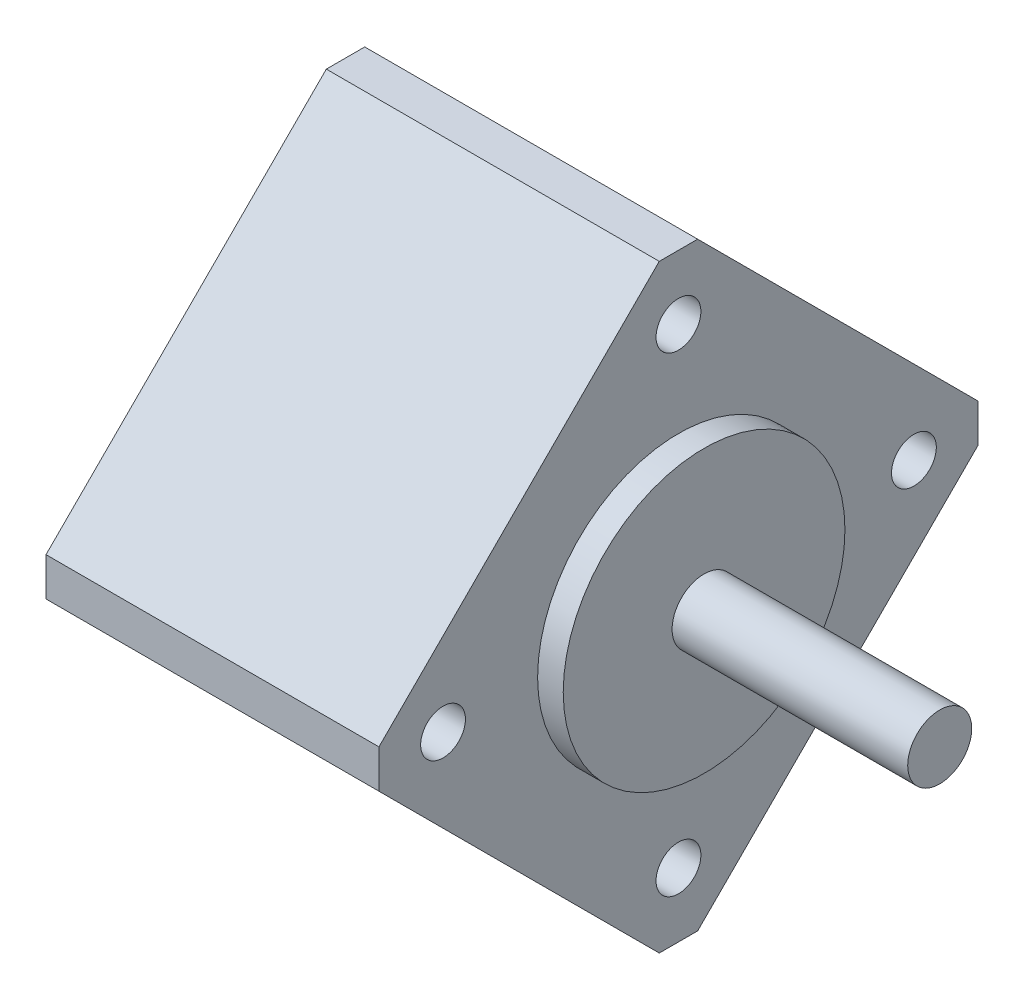
ISO-10303-21;
HEADER;
FILE_DESCRIPTION(('STEP AP214'),'2;1');
FILE_NAME('part.step','',(''),(''),'','','');
FILE_SCHEMA(('AUTOMOTIVE_DESIGN { 1 0 10303 214 1 1 1 1 }'));
ENDSEC;
DATA;
#1=APPLICATION_CONTEXT('core data for automotive mechanical design processes');
#2=APPLICATION_PROTOCOL_DEFINITION('international standard','automotive_design',2000,#1);
#3=PRODUCT_CONTEXT('',#1,'mechanical');
#4=PRODUCT('Part','Part','',(#3));
#5=PRODUCT_RELATED_PRODUCT_CATEGORY('part','',(#4));
#6=PRODUCT_DEFINITION_FORMATION('','',#4);
#7=PRODUCT_DEFINITION_CONTEXT('part definition',#1,'design');
#8=PRODUCT_DEFINITION('design','',#6,#7);
#9=PRODUCT_DEFINITION_SHAPE('','',#8);
#10=(LENGTH_UNIT() NAMED_UNIT(*) SI_UNIT(.MILLI.,.METRE.));
#11=(NAMED_UNIT(*) PLANE_ANGLE_UNIT() SI_UNIT($,.RADIAN.));
#12=(NAMED_UNIT(*) SI_UNIT($,.STERADIAN.) SOLID_ANGLE_UNIT());
#13=UNCERTAINTY_MEASURE_WITH_UNIT(LENGTH_MEASURE(1.E-05),#10,'distance_accuracy_value','');
#14=(GEOMETRIC_REPRESENTATION_CONTEXT(3) GLOBAL_UNCERTAINTY_ASSIGNED_CONTEXT((#13)) GLOBAL_UNIT_ASSIGNED_CONTEXT((#10,
#11,#12)) REPRESENTATION_CONTEXT('',''));
#15=CARTESIAN_POINT('',(0.,0.,0.));
#16=DIRECTION('',(0.,0.,1.));
#17=DIRECTION('',(1.,0.,0.));
#18=AXIS2_PLACEMENT_3D('',#15,#16,#17);
#19=CARTESIAN_POINT('',(0.,0.,0.));
#20=DIRECTION('',(-1.,0.,0.));
#21=DIRECTION('',(0.,0.,1.));
#22=AXIS2_PLACEMENT_3D('',#19,#20,#21);
#23=CYLINDRICAL_SURFACE('',#22,2.49999995299999);
#24=CARTESIAN_POINT('',(18.40000003,0.,0.));
#25=DIRECTION('',(-1.,0.,0.));
#26=DIRECTION('',(0.,0.,1.));
#27=AXIS2_PLACEMENT_3D('',#24,#25,#26);
#28=CIRCLE('',#27,2.49999995299999);
#29=CARTESIAN_POINT('',(18.40000003,0.,2.49999995299999));
#30=VERTEX_POINT('',#29);
#31=EDGE_CURVE('E171',#30,#30,#28,.T.);
#32=ORIENTED_EDGE('',*,*,#31,.T.);
#33=EDGE_LOOP('',(#32));
#34=FACE_BOUND('',#33,.T.);
#35=CARTESIAN_POINT('',(0.,0.,0.));
#36=DIRECTION('',(-1.,0.,0.));
#37=DIRECTION('',(0.,0.,1.));
#38=AXIS2_PLACEMENT_3D('',#35,#36,#37);
#39=CIRCLE('',#38,2.499999953);
#40=CARTESIAN_POINT('',(0.,0.,2.499999953));
#41=VERTEX_POINT('',#40);
#42=EDGE_CURVE('E11',#41,#41,#39,.T.);
#43=ORIENTED_EDGE('',*,*,#42,.F.);
#44=EDGE_LOOP('',(#43));
#45=FACE_BOUND('',#44,.T.);
#46=ADVANCED_FACE('F39',(#34,#45),#23,.T.);
#47=CARTESIAN_POINT('',(0.,0.,0.));
#48=DIRECTION('',(-1.,0.,0.));
#49=DIRECTION('',(0.,0.,1.));
#50=AXIS2_PLACEMENT_3D('',#47,#48,#49);
#51=PLANE('',#50);
#52=CARTESIAN_POINT('',(0.,0.,0.));
#53=DIRECTION('',(-1.,0.,0.));
#54=DIRECTION('',(0.,0.,1.));
#55=AXIS2_PLACEMENT_3D('',#52,#53,#54);
#56=CIRCLE('',#55,10.999999971);
#57=CARTESIAN_POINT('',(0.,0.,10.999999971));
#58=VERTEX_POINT('',#57);
#59=EDGE_CURVE('E47',#58,#58,#56,.T.);
#60=ORIENTED_EDGE('',*,*,#59,.F.);
#61=EDGE_LOOP('',(#60));
#62=FACE_BOUND('',#61,.T.);
#63=ORIENTED_EDGE('',*,*,#42,.T.);
#64=EDGE_LOOP('',(#63));
#65=FACE_BOUND('',#64,.T.);
#66=ADVANCED_FACE('F181',(#62,#65),#51,.F.);
#67=CARTESIAN_POINT('',(0.,0.,0.));
#68=DIRECTION('',(-1.,0.,0.));
#69=DIRECTION('',(0.,0.,1.));
#70=AXIS2_PLACEMENT_3D('',#67,#68,#69);
#71=CYLINDRICAL_SURFACE('',#70,10.999999971);
#72=CARTESIAN_POINT('',(-2.000000064,0.,0.));
#73=DIRECTION('',(-1.,0.,0.));
#74=DIRECTION('',(0.,0.,1.));
#75=AXIS2_PLACEMENT_3D('',#72,#73,#74);
#76=CIRCLE('',#75,10.999999971);
#77=CARTESIAN_POINT('',(-2.000000064,0.,10.999999971));
#78=VERTEX_POINT('',#77);
#79=EDGE_CURVE('E174',#78,#78,#76,.T.);
#80=ORIENTED_EDGE('',*,*,#79,.F.);
#81=EDGE_LOOP('',(#80));
#82=FACE_BOUND('',#81,.T.);
#83=ORIENTED_EDGE('',*,*,#59,.T.);
#84=EDGE_LOOP('',(#83));
#85=FACE_BOUND('',#84,.T.);
#86=ADVANCED_FACE('F179',(#82,#85),#71,.T.);
#87=CARTESIAN_POINT('',(18.40000003,0.,0.));
#88=DIRECTION('',(-1.,0.,0.));
#89=DIRECTION('',(0.,0.,1.));
#90=AXIS2_PLACEMENT_3D('',#87,#88,#89);
#91=PLANE('',#90);
#92=ORIENTED_EDGE('',*,*,#31,.F.);
#93=EDGE_LOOP('',(#92));
#94=FACE_BOUND('',#93,.T.);
#95=ADVANCED_FACE('F192',(#94),#91,.F.);
#96=CARTESIAN_POINT('',(-28.000000064,0.,0.));
#97=DIRECTION('',(1.,0.,0.));
#98=DIRECTION('',(0.,0.,-1.));
#99=AXIS2_PLACEMENT_3D('',#96,#97,#98);
#100=PLANE('',#99);
#101=DIRECTION('',(0.,0.,-1.));
#102=VECTOR('',#101,1.);
#103=CARTESIAN_POINT('',(-28.000000064,23.3901586977665,-1.5));
#104=LINE('',#103,#102);
#105=CARTESIAN_POINT('',(-28.000000064,23.3901586977665,1.5));
#106=VERTEX_POINT('',#105);
#107=CARTESIAN_POINT('',(-28.000000064,23.3901586977665,-1.5));
#108=VERTEX_POINT('',#107);
#109=EDGE_CURVE('E55',#106,#108,#104,.T.);
#110=ORIENTED_EDGE('',*,*,#109,.T.);
#111=DIRECTION('',(0.,-0.707106781186548,-0.707106781186547));
#112=VECTOR('',#111,1.);
#113=CARTESIAN_POINT('',(-28.000000064,1.5,-23.3901586977665));
#114=LINE('',#113,#112);
#115=CARTESIAN_POINT('',(-28.000000064,1.5,-23.3901586977665));
#116=VERTEX_POINT('',#115);
#117=EDGE_CURVE('E99',#108,#116,#114,.T.);
#118=ORIENTED_EDGE('',*,*,#117,.T.);
#119=DIRECTION('',(0.,-1.,0.));
#120=VECTOR('',#119,1.);
#121=CARTESIAN_POINT('',(-28.000000064,0.,-23.3901586977665));
#122=LINE('',#121,#120);
#123=CARTESIAN_POINT('',(-28.000000064,-1.5,-23.3901586977665));
#124=VERTEX_POINT('',#123);
#125=EDGE_CURVE('E279',#116,#124,#122,.T.);
#126=ORIENTED_EDGE('',*,*,#125,.T.);
#127=DIRECTION('',(0.,-0.707106781186548,0.707106781186547));
#128=VECTOR('',#127,1.);
#129=CARTESIAN_POINT('',(-28.000000064,-23.3901586977665,-1.5));
#130=LINE('',#129,#128);
#131=CARTESIAN_POINT('',(-28.000000064,-23.3901586977665,-1.5));
#132=VERTEX_POINT('',#131);
#133=EDGE_CURVE('E281',#124,#132,#130,.T.);
#134=ORIENTED_EDGE('',*,*,#133,.T.);
#135=DIRECTION('',(0.,0.,1.));
#136=VECTOR('',#135,1.);
#137=CARTESIAN_POINT('',(-28.000000064,-23.3901586977665,0.));
#138=LINE('',#137,#136);
#139=CARTESIAN_POINT('',(-28.000000064,-23.3901586977665,1.5));
#140=VERTEX_POINT('',#139);
#141=EDGE_CURVE('E120',#132,#140,#138,.T.);
#142=ORIENTED_EDGE('',*,*,#141,.T.);
#143=DIRECTION('',(0.,0.707106781186547,0.707106781186547));
#144=VECTOR('',#143,1.);
#145=CARTESIAN_POINT('',(-28.000000064,-1.5,23.3901586977665));
#146=LINE('',#145,#144);
#147=CARTESIAN_POINT('',(-28.000000064,-1.5,23.3901586977665));
#148=VERTEX_POINT('',#147);
#149=EDGE_CURVE('E113',#140,#148,#146,.T.);
#150=ORIENTED_EDGE('',*,*,#149,.T.);
#151=DIRECTION('',(0.,1.,0.));
#152=VECTOR('',#151,1.);
#153=CARTESIAN_POINT('',(-28.000000064,0.,23.3901586977665));
#154=LINE('',#153,#152);
#155=CARTESIAN_POINT('',(-28.000000064,1.5,23.3901586977665));
#156=VERTEX_POINT('',#155);
#157=EDGE_CURVE('E118',#148,#156,#154,.T.);
#158=ORIENTED_EDGE('',*,*,#157,.T.);
#159=DIRECTION('',(0.,0.707106781186548,-0.707106781186547));
#160=VECTOR('',#159,1.);
#161=CARTESIAN_POINT('',(-28.000000064,23.3901586977665,1.5));
#162=LINE('',#161,#160);
#163=EDGE_CURVE('E135',#156,#106,#162,.T.);
#164=ORIENTED_EDGE('',*,*,#163,.T.);
#165=EDGE_LOOP('',(#110,#118,#126,#134,#142,#150,#158,#164));
#166=FACE_BOUND('',#165,.T.);
#167=CARTESIAN_POINT('',(-28.000000064,0.,18.3847763108502));
#168=DIRECTION('',(-1.,0.,0.));
#169=DIRECTION('',(0.,0.,1.));
#170=AXIS2_PLACEMENT_3D('',#167,#168,#169);
#171=CIRCLE('',#170,1.75000000000015);
#172=CARTESIAN_POINT('',(-28.000000064,0.,20.1347763108504));
#173=VERTEX_POINT('',#172);
#174=EDGE_CURVE('E145',#173,#173,#171,.T.);
#175=ORIENTED_EDGE('',*,*,#174,.F.);
#176=EDGE_LOOP('',(#175));
#177=FACE_BOUND('',#176,.T.);
#178=CARTESIAN_POINT('',(-28.000000064,18.3847763108502,0.));
#179=DIRECTION('',(-1.,0.,0.));
#180=DIRECTION('',(0.,0.,1.));
#181=AXIS2_PLACEMENT_3D('',#178,#179,#180);
#182=CIRCLE('',#181,1.74999999999951);
#183=CARTESIAN_POINT('',(-28.000000064,18.3847763108502,1.74999999999951));
#184=VERTEX_POINT('',#183);
#185=EDGE_CURVE('E267',#184,#184,#182,.T.);
#186=ORIENTED_EDGE('',*,*,#185,.F.);
#187=EDGE_LOOP('',(#186));
#188=FACE_BOUND('',#187,.T.);
#189=CARTESIAN_POINT('',(-28.000000064,-18.3847763108502,5.19441260837805E-13));
#190=DIRECTION('',(-1.,0.,0.));
#191=DIRECTION('',(0.,0.,1.));
#192=AXIS2_PLACEMENT_3D('',#189,#190,#191);
#193=CIRCLE('',#192,1.75);
#194=CARTESIAN_POINT('',(-28.000000064,-18.3847763108502,1.75000000000052));
#195=VERTEX_POINT('',#194);
#196=EDGE_CURVE('E261',#195,#195,#193,.T.);
#197=ORIENTED_EDGE('',*,*,#196,.F.);
#198=EDGE_LOOP('',(#197));
#199=FACE_BOUND('',#198,.T.);
#200=CARTESIAN_POINT('',(-28.000000064,0.,-18.3847763108502));
#201=DIRECTION('',(-1.,0.,0.));
#202=DIRECTION('',(0.,0.,1.));
#203=AXIS2_PLACEMENT_3D('',#200,#201,#202);
#204=CIRCLE('',#203,1.74999999999985);
#205=CARTESIAN_POINT('',(-28.000000064,0.,-16.6347763108504));
#206=VERTEX_POINT('',#205);
#207=EDGE_CURVE('E252',#206,#206,#204,.T.);
#208=ORIENTED_EDGE('',*,*,#207,.F.);
#209=EDGE_LOOP('',(#208));
#210=FACE_BOUND('',#209,.T.);
#211=ADVANCED_FACE('F115',(#166,#177,#188,#199,#210),#100,.F.);
#212=CARTESIAN_POINT('',(-2.000000064,0.,0.));
#213=DIRECTION('',(1.,0.,0.));
#214=DIRECTION('',(0.,0.,-1.));
#215=AXIS2_PLACEMENT_3D('',#212,#213,#214);
#216=PLANE('',#215);
#217=ORIENTED_EDGE('',*,*,#79,.T.);
#218=EDGE_LOOP('',(#217));
#219=FACE_BOUND('',#218,.T.);
#220=CARTESIAN_POINT('',(-2.000000064,-18.3847763108502,5.19441260837805E-13));
#221=DIRECTION('',(-1.,0.,0.));
#222=DIRECTION('',(0.,0.,1.));
#223=AXIS2_PLACEMENT_3D('',#220,#221,#222);
#224=CIRCLE('',#223,1.75);
#225=CARTESIAN_POINT('',(-2.000000064,-18.3847763108502,1.75000000000052));
#226=VERTEX_POINT('',#225);
#227=EDGE_CURVE('E258',#226,#226,#224,.T.);
#228=ORIENTED_EDGE('',*,*,#227,.T.);
#229=EDGE_LOOP('',(#228));
#230=FACE_BOUND('',#229,.T.);
#231=CARTESIAN_POINT('',(-2.000000064,0.,18.3847763108502));
#232=DIRECTION('',(-1.,0.,0.));
#233=DIRECTION('',(0.,0.,1.));
#234=AXIS2_PLACEMENT_3D('',#231,#232,#233);
#235=CIRCLE('',#234,1.75000000000015);
#236=CARTESIAN_POINT('',(-2.000000064,0.,20.1347763108504));
#237=VERTEX_POINT('',#236);
#238=EDGE_CURVE('E270',#237,#237,#235,.T.);
#239=ORIENTED_EDGE('',*,*,#238,.T.);
#240=EDGE_LOOP('',(#239));
#241=FACE_BOUND('',#240,.T.);
#242=DIRECTION('',(0.,-0.707106781186548,-0.707106781186547));
#243=VECTOR('',#242,1.);
#244=CARTESIAN_POINT('',(-2.000000064,1.5,-23.3901586977665));
#245=LINE('',#244,#243);
#246=CARTESIAN_POINT('',(-2.000000064,23.3901586977665,-1.5));
#247=VERTEX_POINT('',#246);
#248=CARTESIAN_POINT('',(-2.000000064,1.5,-23.3901586977665));
#249=VERTEX_POINT('',#248);
#250=EDGE_CURVE('E141',#247,#249,#245,.T.);
#251=ORIENTED_EDGE('',*,*,#250,.F.);
#252=DIRECTION('',(0.,0.,-1.));
#253=VECTOR('',#252,1.);
#254=CARTESIAN_POINT('',(-2.000000064,23.3901586977665,0.));
#255=LINE('',#254,#253);
#256=CARTESIAN_POINT('',(-2.000000064,23.3901586977665,1.5));
#257=VERTEX_POINT('',#256);
#258=EDGE_CURVE('E155',#257,#247,#255,.T.);
#259=ORIENTED_EDGE('',*,*,#258,.F.);
#260=DIRECTION('',(0.,0.707106781186548,-0.707106781186547));
#261=VECTOR('',#260,1.);
#262=CARTESIAN_POINT('',(-2.000000064,23.3901586977665,1.5));
#263=LINE('',#262,#261);
#264=CARTESIAN_POINT('',(-2.000000064,1.5,23.3901586977665));
#265=VERTEX_POINT('',#264);
#266=EDGE_CURVE('E91',#265,#257,#263,.T.);
#267=ORIENTED_EDGE('',*,*,#266,.F.);
#268=DIRECTION('',(0.,1.,0.));
#269=VECTOR('',#268,1.);
#270=CARTESIAN_POINT('',(-2.000000064,1.5,23.3901586977665));
#271=LINE('',#270,#269);
#272=CARTESIAN_POINT('',(-2.000000064,-1.5,23.3901586977665));
#273=VERTEX_POINT('',#272);
#274=EDGE_CURVE('E84',#273,#265,#271,.T.);
#275=ORIENTED_EDGE('',*,*,#274,.F.);
#276=DIRECTION('',(0.,0.707106781186547,0.707106781186547));
#277=VECTOR('',#276,1.);
#278=CARTESIAN_POINT('',(-2.000000064,-1.5,23.3901586977665));
#279=LINE('',#278,#277);
#280=CARTESIAN_POINT('',(-2.000000064,-23.3901586977665,1.5));
#281=VERTEX_POINT('',#280);
#282=EDGE_CURVE('E129',#281,#273,#279,.T.);
#283=ORIENTED_EDGE('',*,*,#282,.F.);
#284=DIRECTION('',(0.,0.,1.));
#285=VECTOR('',#284,1.);
#286=CARTESIAN_POINT('',(-2.000000064,-23.3901586977665,1.5));
#287=LINE('',#286,#285);
#288=CARTESIAN_POINT('',(-2.000000064,-23.3901586977665,-1.5));
#289=VERTEX_POINT('',#288);
#290=EDGE_CURVE('E150',#289,#281,#287,.T.);
#291=ORIENTED_EDGE('',*,*,#290,.F.);
#292=DIRECTION('',(0.,-0.707106781186548,0.707106781186547));
#293=VECTOR('',#292,1.);
#294=CARTESIAN_POINT('',(-2.000000064,-23.3901586977665,-1.5));
#295=LINE('',#294,#293);
#296=CARTESIAN_POINT('',(-2.000000064,-1.5,-23.3901586977665));
#297=VERTEX_POINT('',#296);
#298=EDGE_CURVE('E147',#297,#289,#295,.T.);
#299=ORIENTED_EDGE('',*,*,#298,.F.);
#300=DIRECTION('',(0.,-1.,0.));
#301=VECTOR('',#300,1.);
#302=CARTESIAN_POINT('',(-2.000000064,-1.5,-23.3901586977665));
#303=LINE('',#302,#301);
#304=EDGE_CURVE('E144',#249,#297,#303,.T.);
#305=ORIENTED_EDGE('',*,*,#304,.F.);
#306=EDGE_LOOP('',(#251,#259,#267,#275,#283,#291,#299,#305));
#307=FACE_BOUND('',#306,.T.);
#308=CARTESIAN_POINT('',(-2.000000064,18.3847763108502,0.));
#309=DIRECTION('',(-1.,0.,0.));
#310=DIRECTION('',(0.,0.,1.));
#311=AXIS2_PLACEMENT_3D('',#308,#309,#310);
#312=CIRCLE('',#311,1.74999999999951);
#313=CARTESIAN_POINT('',(-2.000000064,18.3847763108502,1.74999999999951));
#314=VERTEX_POINT('',#313);
#315=EDGE_CURVE('E264',#314,#314,#312,.T.);
#316=ORIENTED_EDGE('',*,*,#315,.T.);
#317=EDGE_LOOP('',(#316));
#318=FACE_BOUND('',#317,.T.);
#319=CARTESIAN_POINT('',(-2.000000064,0.,-18.3847763108502));
#320=DIRECTION('',(-1.,0.,0.));
#321=DIRECTION('',(0.,0.,1.));
#322=AXIS2_PLACEMENT_3D('',#319,#320,#321);
#323=CIRCLE('',#322,1.74999999999985);
#324=CARTESIAN_POINT('',(-2.000000064,0.,-16.6347763108504));
#325=VERTEX_POINT('',#324);
#326=EDGE_CURVE('E255',#325,#325,#323,.T.);
#327=ORIENTED_EDGE('',*,*,#326,.T.);
#328=EDGE_LOOP('',(#327));
#329=FACE_BOUND('',#328,.T.);
#330=ADVANCED_FACE('F199',(#219,#230,#241,#307,#318,#329),#216,.T.);
#331=CARTESIAN_POINT('',(-28.000000064,1.5,-23.3901586977665));
#332=DIRECTION('',(0.,-0.707106781186547,0.707106781186548));
#333=DIRECTION('',(0.,-0.707106781186548,-0.707106781186547));
#334=AXIS2_PLACEMENT_3D('',#331,#332,#333);
#335=PLANE('',#334);
#336=ORIENTED_EDGE('',*,*,#250,.T.);
#337=DIRECTION('',(1.,0.,0.));
#338=VECTOR('',#337,1.);
#339=CARTESIAN_POINT('',(-28.000000064,1.5,-23.3901586977665));
#340=LINE('',#339,#338);
#341=EDGE_CURVE('E166',#116,#249,#340,.T.);
#342=ORIENTED_EDGE('',*,*,#341,.F.);
#343=ORIENTED_EDGE('',*,*,#117,.F.);
#344=DIRECTION('',(1.,0.,0.));
#345=VECTOR('',#344,1.);
#346=CARTESIAN_POINT('',(-28.000000064,23.3901586977665,-1.5));
#347=LINE('',#346,#345);
#348=EDGE_CURVE('E169',#108,#247,#347,.T.);
#349=ORIENTED_EDGE('',*,*,#348,.T.);
#350=EDGE_LOOP('',(#336,#342,#343,#349));
#351=FACE_BOUND('',#350,.T.);
#352=ADVANCED_FACE('F204',(#351),#335,.F.);
#353=CARTESIAN_POINT('',(-28.000000064,-1.5,-23.3901586977665));
#354=DIRECTION('',(0.,0.,1.));
#355=DIRECTION('',(1.,0.,0.));
#356=AXIS2_PLACEMENT_3D('',#353,#354,#355);
#357=PLANE('',#356);
#358=ORIENTED_EDGE('',*,*,#304,.T.);
#359=DIRECTION('',(1.,0.,0.));
#360=VECTOR('',#359,1.);
#361=CARTESIAN_POINT('',(-28.000000064,-1.5,-23.3901586977665));
#362=LINE('',#361,#360);
#363=EDGE_CURVE('E163',#124,#297,#362,.T.);
#364=ORIENTED_EDGE('',*,*,#363,.F.);
#365=ORIENTED_EDGE('',*,*,#125,.F.);
#366=ORIENTED_EDGE('',*,*,#341,.T.);
#367=EDGE_LOOP('',(#358,#364,#365,#366));
#368=FACE_BOUND('',#367,.T.);
#369=ADVANCED_FACE('F207',(#368),#357,.F.);
#370=CARTESIAN_POINT('',(-28.000000064,-23.3901586977665,-1.5));
#371=DIRECTION('',(0.,0.707106781186547,0.707106781186548));
#372=DIRECTION('',(0.,-0.707106781186548,0.707106781186547));
#373=AXIS2_PLACEMENT_3D('',#370,#371,#372);
#374=PLANE('',#373);
#375=ORIENTED_EDGE('',*,*,#298,.T.);
#376=DIRECTION('',(1.,0.,0.));
#377=VECTOR('',#376,1.);
#378=CARTESIAN_POINT('',(-28.000000064,-23.3901586977665,-1.5));
#379=LINE('',#378,#377);
#380=EDGE_CURVE('E160',#132,#289,#379,.T.);
#381=ORIENTED_EDGE('',*,*,#380,.F.);
#382=ORIENTED_EDGE('',*,*,#133,.F.);
#383=ORIENTED_EDGE('',*,*,#363,.T.);
#384=EDGE_LOOP('',(#375,#381,#382,#383));
#385=FACE_BOUND('',#384,.T.);
#386=ADVANCED_FACE('F210',(#385),#374,.F.);
#387=CARTESIAN_POINT('',(-28.000000064,-23.3901586977665,1.5));
#388=DIRECTION('',(0.,1.,0.));
#389=DIRECTION('',(0.,0.,1.));
#390=AXIS2_PLACEMENT_3D('',#387,#388,#389);
#391=PLANE('',#390);
#392=ORIENTED_EDGE('',*,*,#290,.T.);
#393=DIRECTION('',(1.,0.,0.));
#394=VECTOR('',#393,1.);
#395=CARTESIAN_POINT('',(-28.000000064,-23.3901586977665,1.5));
#396=LINE('',#395,#394);
#397=EDGE_CURVE('E130',#140,#281,#396,.T.);
#398=ORIENTED_EDGE('',*,*,#397,.F.);
#399=ORIENTED_EDGE('',*,*,#141,.F.);
#400=ORIENTED_EDGE('',*,*,#380,.T.);
#401=EDGE_LOOP('',(#392,#398,#399,#400));
#402=FACE_BOUND('',#401,.T.);
#403=ADVANCED_FACE('F214',(#402),#391,.F.);
#404=CARTESIAN_POINT('',(-28.000000064,-1.5,23.3901586977665));
#405=DIRECTION('',(0.,0.707106781186548,-0.707106781186548));
#406=DIRECTION('',(0.,0.707106781186548,0.707106781186548));
#407=AXIS2_PLACEMENT_3D('',#404,#405,#406);
#408=PLANE('',#407);
#409=ORIENTED_EDGE('',*,*,#282,.T.);
#410=DIRECTION('',(1.,0.,0.));
#411=VECTOR('',#410,1.);
#412=CARTESIAN_POINT('',(-28.000000064,-1.5,23.3901586977665));
#413=LINE('',#412,#411);
#414=EDGE_CURVE('E126',#148,#273,#413,.T.);
#415=ORIENTED_EDGE('',*,*,#414,.F.);
#416=ORIENTED_EDGE('',*,*,#149,.F.);
#417=ORIENTED_EDGE('',*,*,#397,.T.);
#418=EDGE_LOOP('',(#409,#415,#416,#417));
#419=FACE_BOUND('',#418,.T.);
#420=ADVANCED_FACE('F127',(#419),#408,.F.);
#421=CARTESIAN_POINT('',(-28.000000064,1.5,23.3901586977665));
#422=DIRECTION('',(0.,0.,-1.));
#423=DIRECTION('',(-1.,0.,0.));
#424=AXIS2_PLACEMENT_3D('',#421,#422,#423);
#425=PLANE('',#424);
#426=ORIENTED_EDGE('',*,*,#274,.T.);
#427=DIRECTION('',(1.,0.,0.));
#428=VECTOR('',#427,1.);
#429=CARTESIAN_POINT('',(-28.000000064,1.5,23.3901586977665));
#430=LINE('',#429,#428);
#431=EDGE_CURVE('E131',#156,#265,#430,.T.);
#432=ORIENTED_EDGE('',*,*,#431,.F.);
#433=ORIENTED_EDGE('',*,*,#157,.F.);
#434=ORIENTED_EDGE('',*,*,#414,.T.);
#435=EDGE_LOOP('',(#426,#432,#433,#434));
#436=FACE_BOUND('',#435,.T.);
#437=ADVANCED_FACE('F133',(#436),#425,.F.);
#438=CARTESIAN_POINT('',(-28.000000064,23.3901586977665,1.5));
#439=DIRECTION('',(0.,-0.707106781186547,-0.707106781186548));
#440=DIRECTION('',(0.,0.707106781186548,-0.707106781186547));
#441=AXIS2_PLACEMENT_3D('',#438,#439,#440);
#442=PLANE('',#441);
#443=ORIENTED_EDGE('',*,*,#266,.T.);
#444=DIRECTION('',(1.,0.,0.));
#445=VECTOR('',#444,1.);
#446=CARTESIAN_POINT('',(-28.000000064,23.3901586977665,1.5));
#447=LINE('',#446,#445);
#448=EDGE_CURVE('E137',#106,#257,#447,.T.);
#449=ORIENTED_EDGE('',*,*,#448,.F.);
#450=ORIENTED_EDGE('',*,*,#163,.F.);
#451=ORIENTED_EDGE('',*,*,#431,.T.);
#452=EDGE_LOOP('',(#443,#449,#450,#451));
#453=FACE_BOUND('',#452,.T.);
#454=ADVANCED_FACE('F223',(#453),#442,.F.);
#455=CARTESIAN_POINT('',(-28.000000064,23.3901586977665,0.));
#456=DIRECTION('',(0.,-1.,0.));
#457=DIRECTION('',(0.,0.,-1.));
#458=AXIS2_PLACEMENT_3D('',#455,#456,#457);
#459=PLANE('',#458);
#460=ORIENTED_EDGE('',*,*,#258,.T.);
#461=ORIENTED_EDGE('',*,*,#348,.F.);
#462=ORIENTED_EDGE('',*,*,#109,.F.);
#463=ORIENTED_EDGE('',*,*,#448,.T.);
#464=EDGE_LOOP('',(#460,#461,#462,#463));
#465=FACE_BOUND('',#464,.T.);
#466=ADVANCED_FACE('F226',(#465),#459,.F.);
#467=CARTESIAN_POINT('',(-28.000000064,0.,18.3847763108502));
#468=DIRECTION('',(1.,0.,0.));
#469=DIRECTION('',(0.,0.,-1.));
#470=AXIS2_PLACEMENT_3D('',#467,#468,#469);
#471=CYLINDRICAL_SURFACE('',#470,1.75000000000015);
#472=ORIENTED_EDGE('',*,*,#174,.T.);
#473=EDGE_LOOP('',(#472));
#474=FACE_BOUND('',#473,.T.);
#475=ORIENTED_EDGE('',*,*,#238,.F.);
#476=EDGE_LOOP('',(#475));
#477=FACE_BOUND('',#476,.T.);
#478=ADVANCED_FACE('F229',(#474,#477),#471,.F.);
#479=CARTESIAN_POINT('',(-28.000000064,18.3847763108502,0.));
#480=DIRECTION('',(1.,0.,0.));
#481=DIRECTION('',(0.,0.,-1.));
#482=AXIS2_PLACEMENT_3D('',#479,#480,#481);
#483=CYLINDRICAL_SURFACE('',#482,1.74999999999951);
#484=ORIENTED_EDGE('',*,*,#185,.T.);
#485=EDGE_LOOP('',(#484));
#486=FACE_BOUND('',#485,.T.);
#487=ORIENTED_EDGE('',*,*,#315,.F.);
#488=EDGE_LOOP('',(#487));
#489=FACE_BOUND('',#488,.T.);
#490=ADVANCED_FACE('F235',(#486,#489),#483,.F.);
#491=CARTESIAN_POINT('',(-28.000000064,-18.3847763108502,5.19441260837805E-13));
#492=DIRECTION('',(1.,0.,0.));
#493=DIRECTION('',(0.,0.,-1.));
#494=AXIS2_PLACEMENT_3D('',#491,#492,#493);
#495=CYLINDRICAL_SURFACE('',#494,1.75);
#496=ORIENTED_EDGE('',*,*,#196,.T.);
#497=EDGE_LOOP('',(#496));
#498=FACE_BOUND('',#497,.T.);
#499=ORIENTED_EDGE('',*,*,#227,.F.);
#500=EDGE_LOOP('',(#499));
#501=FACE_BOUND('',#500,.T.);
#502=ADVANCED_FACE('F239',(#498,#501),#495,.F.);
#503=CARTESIAN_POINT('',(-28.000000064,0.,-18.3847763108502));
#504=DIRECTION('',(1.,0.,0.));
#505=DIRECTION('',(0.,0.,-1.));
#506=AXIS2_PLACEMENT_3D('',#503,#504,#505);
#507=CYLINDRICAL_SURFACE('',#506,1.74999999999985);
#508=ORIENTED_EDGE('',*,*,#207,.T.);
#509=EDGE_LOOP('',(#508));
#510=FACE_BOUND('',#509,.T.);
#511=ORIENTED_EDGE('',*,*,#326,.F.);
#512=EDGE_LOOP('',(#511));
#513=FACE_BOUND('',#512,.T.);
#514=ADVANCED_FACE('F243',(#510,#513),#507,.F.);
#515=CLOSED_SHELL('',(#46,#66,#86,#95,#211,#330,#352,#369,#386,#403,#420,#437,#454,#466,#478,
#490,#502,#514));
#516=MANIFOLD_SOLID_BREP('B2',#515);
#517=ADVANCED_BREP_SHAPE_REPRESENTATION('',(#18,#516),#14);
#518=SHAPE_DEFINITION_REPRESENTATION(#9,#517);
ENDSEC;
END-ISO-10303-21;
